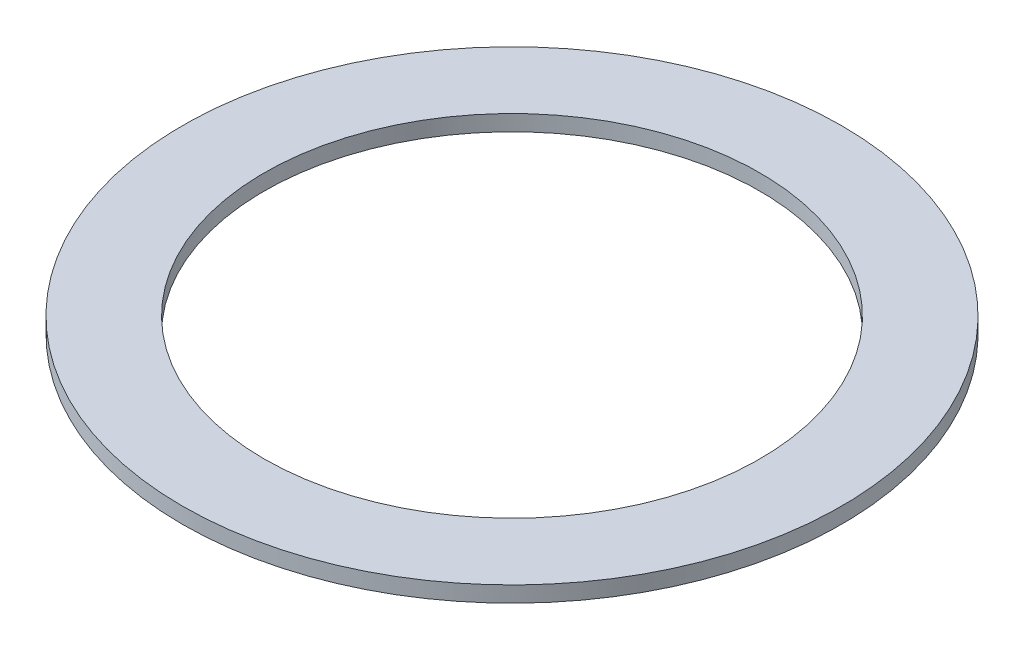
ISO-10303-21;
HEADER;
FILE_DESCRIPTION(('STEP AP214'),'2;1');
FILE_NAME('part.step','',(''),(''),'','','');
FILE_SCHEMA(('AUTOMOTIVE_DESIGN { 1 0 10303 214 1 1 1 1 }'));
ENDSEC;
DATA;
#1=APPLICATION_CONTEXT('core data for automotive mechanical design processes');
#2=APPLICATION_PROTOCOL_DEFINITION('international standard','automotive_design',2000,#1);
#3=PRODUCT_CONTEXT('',#1,'mechanical');
#4=PRODUCT('Part','Part','',(#3));
#5=PRODUCT_RELATED_PRODUCT_CATEGORY('part','',(#4));
#6=PRODUCT_DEFINITION_FORMATION('','',#4);
#7=PRODUCT_DEFINITION_CONTEXT('part definition',#1,'design');
#8=PRODUCT_DEFINITION('design','',#6,#7);
#9=PRODUCT_DEFINITION_SHAPE('','',#8);
#10=(LENGTH_UNIT() NAMED_UNIT(*) SI_UNIT(.MILLI.,.METRE.));
#11=(NAMED_UNIT(*) PLANE_ANGLE_UNIT() SI_UNIT($,.RADIAN.));
#12=(NAMED_UNIT(*) SI_UNIT($,.STERADIAN.) SOLID_ANGLE_UNIT());
#13=UNCERTAINTY_MEASURE_WITH_UNIT(LENGTH_MEASURE(1.E-05),#10,'distance_accuracy_value','');
#14=(GEOMETRIC_REPRESENTATION_CONTEXT(3) GLOBAL_UNCERTAINTY_ASSIGNED_CONTEXT((#13)) GLOBAL_UNIT_ASSIGNED_CONTEXT((#10,
#11,#12)) REPRESENTATION_CONTEXT('',''));
#15=CARTESIAN_POINT('',(0.,0.,0.));
#16=DIRECTION('',(0.,0.,1.));
#17=DIRECTION('',(1.,0.,0.));
#18=AXIS2_PLACEMENT_3D('',#15,#16,#17);
#19=CARTESIAN_POINT('',(0.,0.1524,0.));
#20=DIRECTION('',(0.,1.,0.));
#21=DIRECTION('',(0.,0.,1.));
#22=AXIS2_PLACEMENT_3D('',#19,#20,#21);
#23=PLANE('',#22);
#24=CARTESIAN_POINT('',(0.,0.1524,0.));
#25=DIRECTION('',(0.,1.,0.));
#26=DIRECTION('',(0.,0.,1.));
#27=AXIS2_PLACEMENT_3D('',#24,#25,#26);
#28=CIRCLE('',#27,3.175);
#29=CARTESIAN_POINT('',(0.,0.1524,3.175));
#30=VERTEX_POINT('',#29);
#31=EDGE_CURVE('E10',#30,#30,#28,.T.);
#32=ORIENTED_EDGE('',*,*,#31,.T.);
#33=EDGE_LOOP('',(#32));
#34=FACE_BOUND('',#33,.T.);
#35=CARTESIAN_POINT('',(0.,0.1524,0.));
#36=DIRECTION('',(0.,1.,0.));
#37=DIRECTION('',(0.,0.,1.));
#38=AXIS2_PLACEMENT_3D('',#35,#36,#37);
#39=CIRCLE('',#38,2.3876);
#40=CARTESIAN_POINT('',(0.,0.1524,2.3876));
#41=VERTEX_POINT('',#40);
#42=EDGE_CURVE('E42',#41,#41,#39,.T.);
#43=ORIENTED_EDGE('',*,*,#42,.F.);
#44=EDGE_LOOP('',(#43));
#45=FACE_BOUND('',#44,.T.);
#46=ADVANCED_FACE('F31',(#34,#45),#23,.T.);
#47=CARTESIAN_POINT('',(0.,0.,0.));
#48=DIRECTION('',(0.,1.,0.));
#49=DIRECTION('',(0.,0.,1.));
#50=AXIS2_PLACEMENT_3D('',#47,#48,#49);
#51=PLANE('',#50);
#52=CARTESIAN_POINT('',(0.,0.,0.));
#53=DIRECTION('',(0.,1.,0.));
#54=DIRECTION('',(0.,0.,1.));
#55=AXIS2_PLACEMENT_3D('',#52,#53,#54);
#56=CIRCLE('',#55,3.175);
#57=CARTESIAN_POINT('',(0.,0.,3.175));
#58=VERTEX_POINT('',#57);
#59=EDGE_CURVE('E35',#58,#58,#56,.T.);
#60=ORIENTED_EDGE('',*,*,#59,.F.);
#61=EDGE_LOOP('',(#60));
#62=FACE_BOUND('',#61,.T.);
#63=CARTESIAN_POINT('',(0.,0.,0.));
#64=DIRECTION('',(0.,1.,0.));
#65=DIRECTION('',(0.,0.,1.));
#66=AXIS2_PLACEMENT_3D('',#63,#64,#65);
#67=CIRCLE('',#66,2.3876);
#68=CARTESIAN_POINT('',(0.,0.,2.3876));
#69=VERTEX_POINT('',#68);
#70=EDGE_CURVE('E44',#69,#69,#67,.T.);
#71=ORIENTED_EDGE('',*,*,#70,.T.);
#72=EDGE_LOOP('',(#71));
#73=FACE_BOUND('',#72,.T.);
#74=ADVANCED_FACE('F54',(#62,#73),#51,.F.);
#75=CARTESIAN_POINT('',(0.,0.1524,0.));
#76=DIRECTION('',(0.,-1.,0.));
#77=DIRECTION('',(0.,0.,-1.));
#78=AXIS2_PLACEMENT_3D('',#75,#76,#77);
#79=CYLINDRICAL_SURFACE('',#78,3.175);
#80=ORIENTED_EDGE('',*,*,#31,.F.);
#81=EDGE_LOOP('',(#80));
#82=FACE_BOUND('',#81,.T.);
#83=ORIENTED_EDGE('',*,*,#59,.T.);
#84=EDGE_LOOP('',(#83));
#85=FACE_BOUND('',#84,.T.);
#86=ADVANCED_FACE('F33',(#82,#85),#79,.T.);
#87=CARTESIAN_POINT('',(0.,0.1524,0.));
#88=DIRECTION('',(0.,-1.,0.));
#89=DIRECTION('',(0.,0.,-1.));
#90=AXIS2_PLACEMENT_3D('',#87,#88,#89);
#91=CYLINDRICAL_SURFACE('',#90,2.3876);
#92=ORIENTED_EDGE('',*,*,#42,.T.);
#93=EDGE_LOOP('',(#92));
#94=FACE_BOUND('',#93,.T.);
#95=ORIENTED_EDGE('',*,*,#70,.F.);
#96=EDGE_LOOP('',(#95));
#97=FACE_BOUND('',#96,.T.);
#98=ADVANCED_FACE('F50',(#94,#97),#91,.F.);
#99=CLOSED_SHELL('',(#46,#74,#86,#98));
#100=MANIFOLD_SOLID_BREP('B2',#99);
#101=ADVANCED_BREP_SHAPE_REPRESENTATION('',(#18,#100),#14);
#102=SHAPE_DEFINITION_REPRESENTATION(#9,#101);
ENDSEC;
END-ISO-10303-21;
